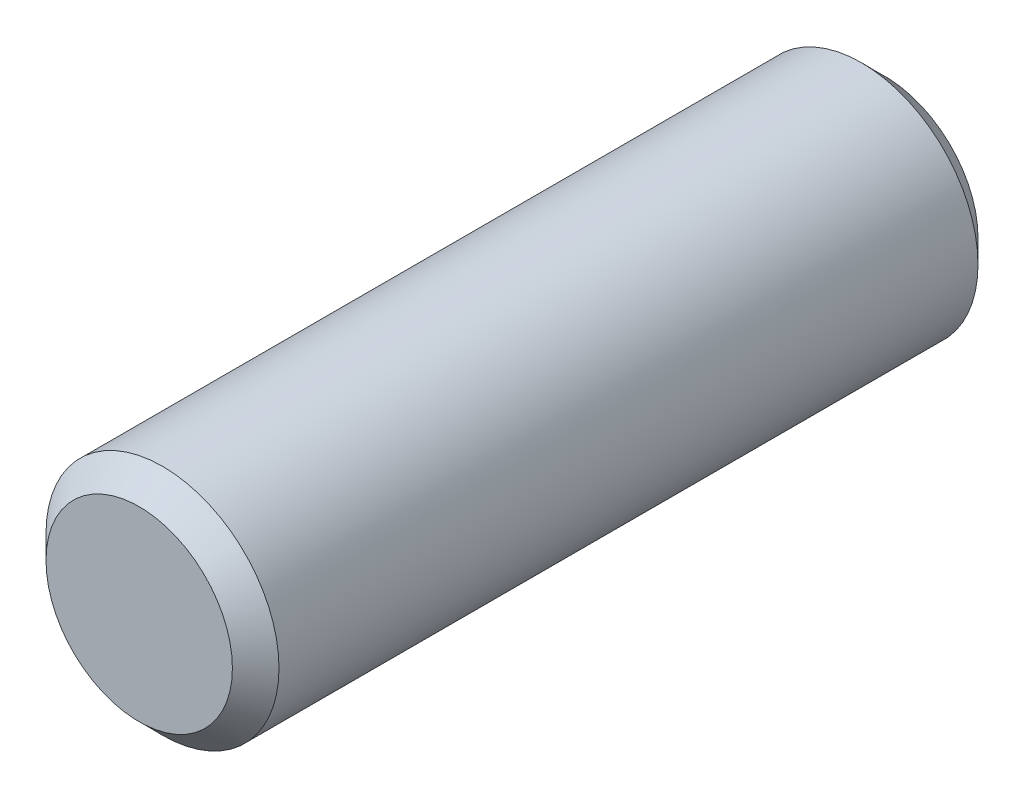
ISO-10303-21;
HEADER;
FILE_DESCRIPTION(('STEP AP214'),'2;1');
FILE_NAME('part.step','',(''),(''),'','','');
FILE_SCHEMA(('AUTOMOTIVE_DESIGN { 1 0 10303 214 1 1 1 1 }'));
ENDSEC;
DATA;
#1=APPLICATION_CONTEXT('core data for automotive mechanical design processes');
#2=APPLICATION_PROTOCOL_DEFINITION('international standard','automotive_design',2000,#1);
#3=PRODUCT_CONTEXT('',#1,'mechanical');
#4=PRODUCT('Part','Part','',(#3));
#5=PRODUCT_RELATED_PRODUCT_CATEGORY('part','',(#4));
#6=PRODUCT_DEFINITION_FORMATION('','',#4);
#7=PRODUCT_DEFINITION_CONTEXT('part definition',#1,'design');
#8=PRODUCT_DEFINITION('design','',#6,#7);
#9=PRODUCT_DEFINITION_SHAPE('','',#8);
#10=(LENGTH_UNIT() NAMED_UNIT(*) SI_UNIT(.MILLI.,.METRE.));
#11=(NAMED_UNIT(*) PLANE_ANGLE_UNIT() SI_UNIT($,.RADIAN.));
#12=(NAMED_UNIT(*) SI_UNIT($,.STERADIAN.) SOLID_ANGLE_UNIT());
#13=UNCERTAINTY_MEASURE_WITH_UNIT(LENGTH_MEASURE(1.E-05),#10,'distance_accuracy_value','');
#14=(GEOMETRIC_REPRESENTATION_CONTEXT(3) GLOBAL_UNCERTAINTY_ASSIGNED_CONTEXT((#13)) GLOBAL_UNIT_ASSIGNED_CONTEXT((#10,
#11,#12)) REPRESENTATION_CONTEXT('',''));
#15=CARTESIAN_POINT('',(0.,0.,0.));
#16=DIRECTION('',(0.,0.,1.));
#17=DIRECTION('',(1.,0.,0.));
#18=AXIS2_PLACEMENT_3D('',#15,#16,#17);
#19=CARTESIAN_POINT('',(0.,0.,8.));
#20=DIRECTION('',(0.,0.,-1.));
#21=DIRECTION('',(-1.,0.,0.));
#22=AXIS2_PLACEMENT_3D('',#19,#20,#21);
#23=CYLINDRICAL_SURFACE('',#22,2.5);
#24=CARTESIAN_POINT('',(0.,0.,-7.5));
#25=DIRECTION('',(0.,0.,1.));
#26=DIRECTION('',(1.,0.,0.));
#27=AXIS2_PLACEMENT_3D('',#24,#25,#26);
#28=CIRCLE('',#27,2.5);
#29=CARTESIAN_POINT('',(2.5,0.,-7.5));
#30=VERTEX_POINT('',#29);
#31=EDGE_CURVE('E59',#30,#30,#28,.T.);
#32=ORIENTED_EDGE('',*,*,#31,.T.);
#33=EDGE_LOOP('',(#32));
#34=FACE_BOUND('',#33,.T.);
#35=CARTESIAN_POINT('',(0.,0.,7.5));
#36=DIRECTION('',(0.,0.,1.));
#37=DIRECTION('',(1.,0.,0.));
#38=AXIS2_PLACEMENT_3D('',#35,#36,#37);
#39=CIRCLE('',#38,2.5);
#40=CARTESIAN_POINT('',(2.5,0.,7.5));
#41=VERTEX_POINT('',#40);
#42=EDGE_CURVE('E64',#41,#41,#39,.F.);
#43=ORIENTED_EDGE('',*,*,#42,.T.);
#44=EDGE_LOOP('',(#43));
#45=FACE_BOUND('',#44,.T.);
#46=ADVANCED_FACE('F45',(#34,#45),#23,.T.);
#47=CARTESIAN_POINT('',(0.,0.,8.));
#48=DIRECTION('',(0.,0.,1.));
#49=DIRECTION('',(1.,0.,0.));
#50=AXIS2_PLACEMENT_3D('',#47,#48,#49);
#51=PLANE('',#50);
#52=CARTESIAN_POINT('',(0.,0.,8.));
#53=DIRECTION('',(0.,0.,1.));
#54=DIRECTION('',(1.,0.,0.));
#55=AXIS2_PLACEMENT_3D('',#52,#53,#54);
#56=CIRCLE('',#55,2.);
#57=CARTESIAN_POINT('',(2.,0.,8.));
#58=VERTEX_POINT('',#57);
#59=EDGE_CURVE('E10',#58,#58,#56,.T.);
#60=ORIENTED_EDGE('',*,*,#59,.T.);
#61=EDGE_LOOP('',(#60));
#62=FACE_BOUND('',#61,.T.);
#63=ADVANCED_FACE('F81',(#62),#51,.T.);
#64=CARTESIAN_POINT('',(0.,0.,-8.));
#65=DIRECTION('',(0.,0.,1.));
#66=DIRECTION('',(1.,0.,0.));
#67=AXIS2_PLACEMENT_3D('',#64,#65,#66);
#68=PLANE('',#67);
#69=CARTESIAN_POINT('',(0.,0.,-8.));
#70=DIRECTION('',(0.,0.,1.));
#71=DIRECTION('',(1.,0.,0.));
#72=AXIS2_PLACEMENT_3D('',#69,#70,#71);
#73=CIRCLE('',#72,2.);
#74=CARTESIAN_POINT('',(2.,0.,-8.));
#75=VERTEX_POINT('',#74);
#76=EDGE_CURVE('E54',#75,#75,#73,.F.);
#77=ORIENTED_EDGE('',*,*,#76,.T.);
#78=EDGE_LOOP('',(#77));
#79=FACE_BOUND('',#78,.T.);
#80=ADVANCED_FACE('F78',(#79),#68,.F.);
#81=CARTESIAN_POINT('',(0.,0.,-7.5));
#82=DIRECTION('',(0.,0.,1.));
#83=DIRECTION('',(1.,0.,0.));
#84=AXIS2_PLACEMENT_3D('',#81,#82,#83);
#85=CONICAL_SURFACE('',#84,2.5,0.78539816339745);
#86=ORIENTED_EDGE('',*,*,#76,.F.);
#87=EDGE_LOOP('',(#86));
#88=FACE_BOUND('',#87,.T.);
#89=ORIENTED_EDGE('',*,*,#31,.F.);
#90=EDGE_LOOP('',(#89));
#91=FACE_BOUND('',#90,.T.);
#92=ADVANCED_FACE('F74',(#88,#91),#85,.T.);
#93=CARTESIAN_POINT('',(0.,0.,8.));
#94=DIRECTION('',(0.,0.,-1.));
#95=DIRECTION('',(-1.,0.,0.));
#96=AXIS2_PLACEMENT_3D('',#93,#94,#95);
#97=CONICAL_SURFACE('',#96,2.,0.785398163397446);
#98=ORIENTED_EDGE('',*,*,#42,.F.);
#99=EDGE_LOOP('',(#98));
#100=FACE_BOUND('',#99,.T.);
#101=ORIENTED_EDGE('',*,*,#59,.F.);
#102=EDGE_LOOP('',(#101));
#103=FACE_BOUND('',#102,.T.);
#104=ADVANCED_FACE('F48',(#100,#103),#97,.T.);
#105=CLOSED_SHELL('',(#46,#63,#80,#92,#104));
#106=MANIFOLD_SOLID_BREP('B2',#105);
#107=ADVANCED_BREP_SHAPE_REPRESENTATION('',(#18,#106),#14);
#108=SHAPE_DEFINITION_REPRESENTATION(#9,#107);
ENDSEC;
END-ISO-10303-21;
